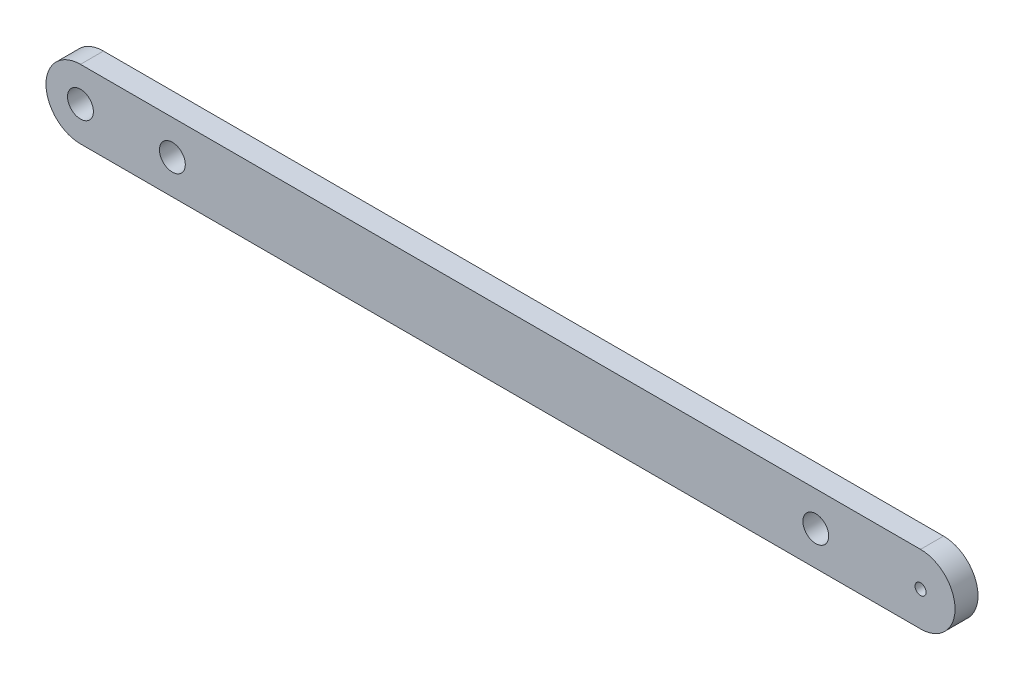
ISO-10303-21;
HEADER;
FILE_DESCRIPTION(('STEP AP214'),'2;1');
FILE_NAME('part.step','',(''),(''),'','','');
FILE_SCHEMA(('AUTOMOTIVE_DESIGN { 1 0 10303 214 1 1 1 1 }'));
ENDSEC;
DATA;
#1=APPLICATION_CONTEXT('core data for automotive mechanical design processes');
#2=APPLICATION_PROTOCOL_DEFINITION('international standard','automotive_design',2000,#1);
#3=PRODUCT_CONTEXT('',#1,'mechanical');
#4=PRODUCT('Part','Part','',(#3));
#5=PRODUCT_RELATED_PRODUCT_CATEGORY('part','',(#4));
#6=PRODUCT_DEFINITION_FORMATION('','',#4);
#7=PRODUCT_DEFINITION_CONTEXT('part definition',#1,'design');
#8=PRODUCT_DEFINITION('design','',#6,#7);
#9=PRODUCT_DEFINITION_SHAPE('','',#8);
#10=(LENGTH_UNIT() NAMED_UNIT(*) SI_UNIT(.MILLI.,.METRE.));
#11=(NAMED_UNIT(*) PLANE_ANGLE_UNIT() SI_UNIT($,.RADIAN.));
#12=(NAMED_UNIT(*) SI_UNIT($,.STERADIAN.) SOLID_ANGLE_UNIT());
#13=UNCERTAINTY_MEASURE_WITH_UNIT(LENGTH_MEASURE(1.E-05),#10,'distance_accuracy_value','');
#14=(GEOMETRIC_REPRESENTATION_CONTEXT(3) GLOBAL_UNCERTAINTY_ASSIGNED_CONTEXT((#13)) GLOBAL_UNIT_ASSIGNED_CONTEXT((#10,
#11,#12)) REPRESENTATION_CONTEXT('',''));
#15=CARTESIAN_POINT('',(0.,0.,0.));
#16=DIRECTION('',(0.,0.,1.));
#17=DIRECTION('',(1.,0.,0.));
#18=AXIS2_PLACEMENT_3D('',#15,#16,#17);
#19=CARTESIAN_POINT('',(-127.,0.,3.175));
#20=DIRECTION('',(0.,0.,1.));
#21=DIRECTION('',(1.,0.,0.));
#22=AXIS2_PLACEMENT_3D('',#19,#20,#21);
#23=PLANE('',#22);
#24=CARTESIAN_POINT('',(-25.4,0.,3.175));
#25=DIRECTION('',(0.,0.,1.));
#26=DIRECTION('',(1.,0.,0.));
#27=AXIS2_PLACEMENT_3D('',#24,#25,#26);
#28=CIRCLE('',#27,1.78600099999999);
#29=CARTESIAN_POINT('',(-23.613999,0.,3.175));
#30=VERTEX_POINT('',#29);
#31=EDGE_CURVE('E130',#30,#30,#28,.T.);
#32=ORIENTED_EDGE('',*,*,#31,.F.);
#33=EDGE_LOOP('',(#32));
#34=FACE_BOUND('',#33,.T.);
#35=CARTESIAN_POINT('',(-114.3,0.,3.175));
#36=DIRECTION('',(0.,0.,1.));
#37=DIRECTION('',(1.,0.,0.));
#38=AXIS2_PLACEMENT_3D('',#35,#36,#37);
#39=CIRCLE('',#38,1.786001);
#40=CARTESIAN_POINT('',(-112.513999,0.,3.175));
#41=VERTEX_POINT('',#40);
#42=EDGE_CURVE('E124',#41,#41,#39,.T.);
#43=ORIENTED_EDGE('',*,*,#42,.F.);
#44=EDGE_LOOP('',(#43));
#45=FACE_BOUND('',#44,.T.);
#46=CARTESIAN_POINT('',(-127.,0.,3.175));
#47=DIRECTION('',(0.,0.,1.));
#48=DIRECTION('',(1.,0.,0.));
#49=AXIS2_PLACEMENT_3D('',#46,#47,#48);
#50=CIRCLE('',#49,1.78600100000001);
#51=CARTESIAN_POINT('',(-125.213999,0.,3.175));
#52=VERTEX_POINT('',#51);
#53=EDGE_CURVE('E118',#52,#52,#50,.T.);
#54=ORIENTED_EDGE('',*,*,#53,.F.);
#55=EDGE_LOOP('',(#54));
#56=FACE_BOUND('',#55,.T.);
#57=CARTESIAN_POINT('',(-127.,0.,3.175));
#58=DIRECTION('',(0.,0.,1.));
#59=DIRECTION('',(1.,0.,0.));
#60=AXIS2_PLACEMENT_3D('',#57,#58,#59);
#61=CIRCLE('',#60,4.7625);
#62=CARTESIAN_POINT('',(-127.,4.76250000000001,3.175));
#63=VERTEX_POINT('',#62);
#64=CARTESIAN_POINT('',(-127.,-4.76249999999999,3.175));
#65=VERTEX_POINT('',#64);
#66=EDGE_CURVE('E84',#63,#65,#61,.T.);
#67=ORIENTED_EDGE('',*,*,#66,.T.);
#68=DIRECTION('',(1.,0.,0.));
#69=VECTOR('',#68,1.);
#70=CARTESIAN_POINT('',(-10.922,-4.76250000000002,3.175));
#71=LINE('',#70,#69);
#72=CARTESIAN_POINT('',(-10.922,-4.76250000000002,3.175));
#73=VERTEX_POINT('',#72);
#74=EDGE_CURVE('E78',#65,#73,#71,.T.);
#75=ORIENTED_EDGE('',*,*,#74,.T.);
#76=CARTESIAN_POINT('',(-10.922,0.,3.175));
#77=DIRECTION('',(0.,0.,1.));
#78=DIRECTION('',(1.,0.,0.));
#79=AXIS2_PLACEMENT_3D('',#76,#77,#78);
#80=CIRCLE('',#79,4.7625);
#81=CARTESIAN_POINT('',(-10.922,4.76249999999998,3.175));
#82=VERTEX_POINT('',#81);
#83=EDGE_CURVE('E81',#73,#82,#80,.T.);
#84=ORIENTED_EDGE('',*,*,#83,.T.);
#85=DIRECTION('',(-1.,0.,0.));
#86=VECTOR('',#85,1.);
#87=CARTESIAN_POINT('',(-25.4,4.76249999999998,3.175));
#88=LINE('',#87,#86);
#89=EDGE_CURVE('E50',#82,#63,#88,.T.);
#90=ORIENTED_EDGE('',*,*,#89,.T.);
#91=EDGE_LOOP('',(#67,#75,#84,#90));
#92=FACE_BOUND('',#91,.T.);
#93=CARTESIAN_POINT('',(-10.922,0.,3.175));
#94=DIRECTION('',(0.,0.,1.));
#95=DIRECTION('',(-1.,0.,0.));
#96=AXIS2_PLACEMENT_3D('',#93,#94,#95);
#97=CIRCLE('',#96,0.762000000000001);
#98=CARTESIAN_POINT('',(-11.684,0.,3.175));
#99=VERTEX_POINT('',#98);
#100=EDGE_CURVE('E101',#99,#99,#97,.T.);
#101=ORIENTED_EDGE('',*,*,#100,.F.);
#102=EDGE_LOOP('',(#101));
#103=FACE_BOUND('',#102,.T.);
#104=ADVANCED_FACE('F33',(#34,#45,#56,#92,#103),#23,.T.);
#105=CARTESIAN_POINT('',(-127.,0.,0.));
#106=DIRECTION('',(0.,0.,1.));
#107=DIRECTION('',(1.,0.,0.));
#108=AXIS2_PLACEMENT_3D('',#105,#106,#107);
#109=PLANE('',#108);
#110=CARTESIAN_POINT('',(-25.4,0.,0.));
#111=DIRECTION('',(0.,0.,1.));
#112=DIRECTION('',(1.,0.,0.));
#113=AXIS2_PLACEMENT_3D('',#110,#111,#112);
#114=CIRCLE('',#113,1.786001);
#115=CARTESIAN_POINT('',(-23.613999,0.,0.));
#116=VERTEX_POINT('',#115);
#117=EDGE_CURVE('E127',#116,#116,#114,.T.);
#118=ORIENTED_EDGE('',*,*,#117,.T.);
#119=EDGE_LOOP('',(#118));
#120=FACE_BOUND('',#119,.T.);
#121=CARTESIAN_POINT('',(-114.3,0.,0.));
#122=DIRECTION('',(0.,0.,1.));
#123=DIRECTION('',(1.,0.,0.));
#124=AXIS2_PLACEMENT_3D('',#121,#122,#123);
#125=CIRCLE('',#124,1.786001);
#126=CARTESIAN_POINT('',(-112.513999,0.,0.));
#127=VERTEX_POINT('',#126);
#128=EDGE_CURVE('E121',#127,#127,#125,.T.);
#129=ORIENTED_EDGE('',*,*,#128,.T.);
#130=EDGE_LOOP('',(#129));
#131=FACE_BOUND('',#130,.T.);
#132=CARTESIAN_POINT('',(-127.,0.,0.));
#133=DIRECTION('',(0.,0.,1.));
#134=DIRECTION('',(1.,0.,0.));
#135=AXIS2_PLACEMENT_3D('',#132,#133,#134);
#136=CIRCLE('',#135,1.78600100000001);
#137=CARTESIAN_POINT('',(-125.213999,0.,0.));
#138=VERTEX_POINT('',#137);
#139=EDGE_CURVE('E113',#138,#138,#136,.T.);
#140=ORIENTED_EDGE('',*,*,#139,.T.);
#141=EDGE_LOOP('',(#140));
#142=FACE_BOUND('',#141,.T.);
#143=CARTESIAN_POINT('',(-127.,0.,0.));
#144=DIRECTION('',(0.,0.,1.));
#145=DIRECTION('',(1.,0.,0.));
#146=AXIS2_PLACEMENT_3D('',#143,#144,#145);
#147=CIRCLE('',#146,4.7625);
#148=CARTESIAN_POINT('',(-127.,4.76250000000001,0.));
#149=VERTEX_POINT('',#148);
#150=CARTESIAN_POINT('',(-127.,-4.76249999999999,0.));
#151=VERTEX_POINT('',#150);
#152=EDGE_CURVE('E98',#149,#151,#147,.T.);
#153=ORIENTED_EDGE('',*,*,#152,.F.);
#154=DIRECTION('',(-1.,0.,0.));
#155=VECTOR('',#154,1.);
#156=CARTESIAN_POINT('',(-25.4,4.76249999999998,0.));
#157=LINE('',#156,#155);
#158=CARTESIAN_POINT('',(-10.922,4.76249999999998,0.));
#159=VERTEX_POINT('',#158);
#160=EDGE_CURVE('E67',#159,#149,#157,.T.);
#161=ORIENTED_EDGE('',*,*,#160,.F.);
#162=CARTESIAN_POINT('',(-10.922,0.,0.));
#163=DIRECTION('',(0.,0.,1.));
#164=DIRECTION('',(1.,0.,0.));
#165=AXIS2_PLACEMENT_3D('',#162,#163,#164);
#166=CIRCLE('',#165,4.7625);
#167=CARTESIAN_POINT('',(-10.922,-4.76250000000002,0.));
#168=VERTEX_POINT('',#167);
#169=EDGE_CURVE('E103',#168,#159,#166,.T.);
#170=ORIENTED_EDGE('',*,*,#169,.F.);
#171=DIRECTION('',(1.,0.,0.));
#172=VECTOR('',#171,1.);
#173=CARTESIAN_POINT('',(-10.922,-4.76250000000002,0.));
#174=LINE('',#173,#172);
#175=EDGE_CURVE('E89',#151,#168,#174,.T.);
#176=ORIENTED_EDGE('',*,*,#175,.F.);
#177=EDGE_LOOP('',(#153,#161,#170,#176));
#178=FACE_BOUND('',#177,.T.);
#179=CARTESIAN_POINT('',(-10.922,0.,0.));
#180=DIRECTION('',(0.,0.,1.));
#181=DIRECTION('',(-1.,0.,0.));
#182=AXIS2_PLACEMENT_3D('',#179,#180,#181);
#183=CIRCLE('',#182,0.762000000000001);
#184=CARTESIAN_POINT('',(-11.684,0.,0.));
#185=VERTEX_POINT('',#184);
#186=EDGE_CURVE('E110',#185,#185,#183,.T.);
#187=ORIENTED_EDGE('',*,*,#186,.T.);
#188=EDGE_LOOP('',(#187));
#189=FACE_BOUND('',#188,.T.);
#190=ADVANCED_FACE('F138',(#120,#131,#142,#178,#189),#109,.F.);
#191=CARTESIAN_POINT('',(-127.,0.,3.175));
#192=DIRECTION('',(0.,0.,-1.));
#193=DIRECTION('',(-1.,0.,0.));
#194=AXIS2_PLACEMENT_3D('',#191,#192,#193);
#195=CYLINDRICAL_SURFACE('',#194,4.7625);
#196=ORIENTED_EDGE('',*,*,#152,.T.);
#197=DIRECTION('',(0.,0.,-1.));
#198=VECTOR('',#197,1.);
#199=CARTESIAN_POINT('',(-127.,-4.76249999999999,3.175));
#200=LINE('',#199,#198);
#201=EDGE_CURVE('E11',#65,#151,#200,.T.);
#202=ORIENTED_EDGE('',*,*,#201,.F.);
#203=ORIENTED_EDGE('',*,*,#66,.F.);
#204=DIRECTION('',(0.,0.,-1.));
#205=VECTOR('',#204,1.);
#206=CARTESIAN_POINT('',(-127.,4.76250000000001,3.175));
#207=LINE('',#206,#205);
#208=EDGE_CURVE('E94',#63,#149,#207,.T.);
#209=ORIENTED_EDGE('',*,*,#208,.T.);
#210=EDGE_LOOP('',(#196,#202,#203,#209));
#211=FACE_BOUND('',#210,.T.);
#212=ADVANCED_FACE('F35',(#211),#195,.T.);
#213=CARTESIAN_POINT('',(-10.922,-4.76250000000002,3.175));
#214=DIRECTION('',(0.,1.,0.));
#215=DIRECTION('',(-1.,0.,0.));
#216=AXIS2_PLACEMENT_3D('',#213,#214,#215);
#217=PLANE('',#216);
#218=ORIENTED_EDGE('',*,*,#175,.T.);
#219=DIRECTION('',(0.,0.,-1.));
#220=VECTOR('',#219,1.);
#221=CARTESIAN_POINT('',(-10.922,-4.76250000000002,3.175));
#222=LINE('',#221,#220);
#223=EDGE_CURVE('E42',#73,#168,#222,.T.);
#224=ORIENTED_EDGE('',*,*,#223,.F.);
#225=ORIENTED_EDGE('',*,*,#74,.F.);
#226=ORIENTED_EDGE('',*,*,#201,.T.);
#227=EDGE_LOOP('',(#218,#224,#225,#226));
#228=FACE_BOUND('',#227,.T.);
#229=ADVANCED_FACE('F88',(#228),#217,.F.);
#230=CARTESIAN_POINT('',(-10.922,0.,3.175));
#231=DIRECTION('',(0.,0.,-1.));
#232=DIRECTION('',(-1.,0.,0.));
#233=AXIS2_PLACEMENT_3D('',#230,#231,#232);
#234=CYLINDRICAL_SURFACE('',#233,4.7625);
#235=ORIENTED_EDGE('',*,*,#169,.T.);
#236=DIRECTION('',(0.,0.,-1.));
#237=VECTOR('',#236,1.);
#238=CARTESIAN_POINT('',(-10.922,4.76249999999998,3.175));
#239=LINE('',#238,#237);
#240=EDGE_CURVE('E91',#82,#159,#239,.T.);
#241=ORIENTED_EDGE('',*,*,#240,.F.);
#242=ORIENTED_EDGE('',*,*,#83,.F.);
#243=ORIENTED_EDGE('',*,*,#223,.T.);
#244=EDGE_LOOP('',(#235,#241,#242,#243));
#245=FACE_BOUND('',#244,.T.);
#246=ADVANCED_FACE('F92',(#245),#234,.T.);
#247=CARTESIAN_POINT('',(-25.4,4.76249999999998,3.175));
#248=DIRECTION('',(0.,-1.,0.));
#249=DIRECTION('',(1.,0.,0.));
#250=AXIS2_PLACEMENT_3D('',#247,#248,#249);
#251=PLANE('',#250);
#252=ORIENTED_EDGE('',*,*,#160,.T.);
#253=ORIENTED_EDGE('',*,*,#208,.F.);
#254=ORIENTED_EDGE('',*,*,#89,.F.);
#255=ORIENTED_EDGE('',*,*,#240,.T.);
#256=EDGE_LOOP('',(#252,#253,#254,#255));
#257=FACE_BOUND('',#256,.T.);
#258=ADVANCED_FACE('F107',(#257),#251,.F.);
#259=CARTESIAN_POINT('',(-10.922,0.,3.175));
#260=DIRECTION('',(0.,0.,-1.));
#261=DIRECTION('',(-1.,0.,0.));
#262=AXIS2_PLACEMENT_3D('',#259,#260,#261);
#263=CYLINDRICAL_SURFACE('',#262,0.762000000000001);
#264=ORIENTED_EDGE('',*,*,#100,.T.);
#265=EDGE_LOOP('',(#264));
#266=FACE_BOUND('',#265,.T.);
#267=ORIENTED_EDGE('',*,*,#186,.F.);
#268=EDGE_LOOP('',(#267));
#269=FACE_BOUND('',#268,.T.);
#270=ADVANCED_FACE('F147',(#266,#269),#263,.F.);
#271=CARTESIAN_POINT('',(-127.,0.,3.175));
#272=DIRECTION('',(0.,0.,1.));
#273=DIRECTION('',(1.,0.,0.));
#274=AXIS2_PLACEMENT_3D('',#271,#272,#273);
#275=CYLINDRICAL_SURFACE('',#274,1.78600100000001);
#276=ORIENTED_EDGE('',*,*,#139,.F.);
#277=EDGE_LOOP('',(#276));
#278=FACE_BOUND('',#277,.T.);
#279=ORIENTED_EDGE('',*,*,#53,.T.);
#280=EDGE_LOOP('',(#279));
#281=FACE_BOUND('',#280,.T.);
#282=ADVANCED_FACE('F144',(#278,#281),#275,.F.);
#283=CARTESIAN_POINT('',(-114.3,0.,3.175));
#284=DIRECTION('',(0.,0.,1.));
#285=DIRECTION('',(1.,0.,0.));
#286=AXIS2_PLACEMENT_3D('',#283,#284,#285);
#287=CYLINDRICAL_SURFACE('',#286,1.786001);
#288=ORIENTED_EDGE('',*,*,#128,.F.);
#289=EDGE_LOOP('',(#288));
#290=FACE_BOUND('',#289,.T.);
#291=ORIENTED_EDGE('',*,*,#42,.T.);
#292=EDGE_LOOP('',(#291));
#293=FACE_BOUND('',#292,.T.);
#294=ADVANCED_FACE('F146',(#290,#293),#287,.F.);
#295=CARTESIAN_POINT('',(-25.4,0.,3.175));
#296=DIRECTION('',(0.,0.,1.));
#297=DIRECTION('',(1.,0.,0.));
#298=AXIS2_PLACEMENT_3D('',#295,#296,#297);
#299=CYLINDRICAL_SURFACE('',#298,1.78600099999999);
#300=ORIENTED_EDGE('',*,*,#117,.F.);
#301=EDGE_LOOP('',(#300));
#302=FACE_BOUND('',#301,.T.);
#303=ORIENTED_EDGE('',*,*,#31,.T.);
#304=EDGE_LOOP('',(#303));
#305=FACE_BOUND('',#304,.T.);
#306=ADVANCED_FACE('F134',(#302,#305),#299,.F.);
#307=CLOSED_SHELL('',(#104,#190,#212,#229,#246,#258,#270,#282,#294,#306));
#308=MANIFOLD_SOLID_BREP('B2',#307);
#309=ADVANCED_BREP_SHAPE_REPRESENTATION('',(#18,#308),#14);
#310=SHAPE_DEFINITION_REPRESENTATION(#9,#309);
ENDSEC;
END-ISO-10303-21;
